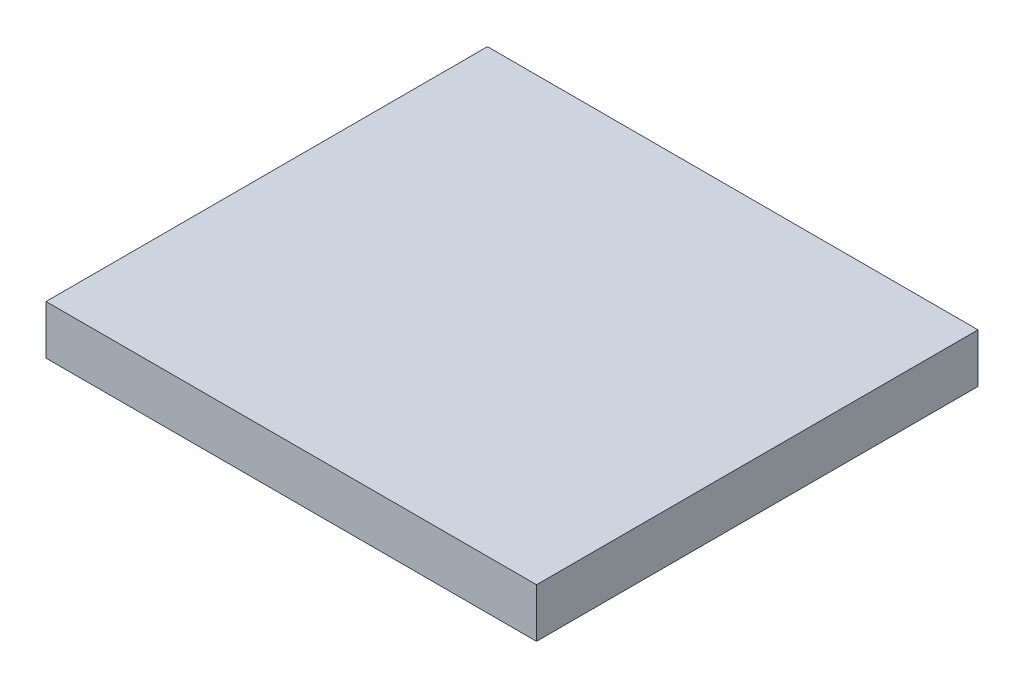
ISO-10303-21;
HEADER;
FILE_DESCRIPTION(('STEP AP214'),'2;1');
FILE_NAME('part.step','',(''),(''),'','','');
FILE_SCHEMA(('AUTOMOTIVE_DESIGN { 1 0 10303 214 1 1 1 1 }'));
ENDSEC;
DATA;
#1=APPLICATION_CONTEXT('core data for automotive mechanical design processes');
#2=APPLICATION_PROTOCOL_DEFINITION('international standard','automotive_design',2000,#1);
#3=PRODUCT_CONTEXT('',#1,'mechanical');
#4=PRODUCT('Part','Part','',(#3));
#5=PRODUCT_RELATED_PRODUCT_CATEGORY('part','',(#4));
#6=PRODUCT_DEFINITION_FORMATION('','',#4);
#7=PRODUCT_DEFINITION_CONTEXT('part definition',#1,'design');
#8=PRODUCT_DEFINITION('design','',#6,#7);
#9=PRODUCT_DEFINITION_SHAPE('','',#8);
#10=(LENGTH_UNIT() NAMED_UNIT(*) SI_UNIT(.MILLI.,.METRE.));
#11=(NAMED_UNIT(*) PLANE_ANGLE_UNIT() SI_UNIT($,.RADIAN.));
#12=(NAMED_UNIT(*) SI_UNIT($,.STERADIAN.) SOLID_ANGLE_UNIT());
#13=UNCERTAINTY_MEASURE_WITH_UNIT(LENGTH_MEASURE(1.E-05),#10,'distance_accuracy_value','');
#14=(GEOMETRIC_REPRESENTATION_CONTEXT(3) GLOBAL_UNCERTAINTY_ASSIGNED_CONTEXT((#13)) GLOBAL_UNIT_ASSIGNED_CONTEXT((#10,
#11,#12)) REPRESENTATION_CONTEXT('',''));
#15=CARTESIAN_POINT('',(0.,0.,0.));
#16=DIRECTION('',(0.,0.,1.));
#17=DIRECTION('',(1.,0.,0.));
#18=AXIS2_PLACEMENT_3D('',#15,#16,#17);
#19=CARTESIAN_POINT('',(50.,10.,-45.));
#20=DIRECTION('',(-1.,0.,0.));
#21=DIRECTION('',(0.,0.,1.));
#22=AXIS2_PLACEMENT_3D('',#19,#20,#21);
#23=PLANE('',#22);
#24=DIRECTION('',(0.,0.,-1.));
#25=VECTOR('',#24,1.);
#26=CARTESIAN_POINT('',(50.,0.,-45.));
#27=LINE('',#26,#25);
#28=CARTESIAN_POINT('',(50.,0.,45.));
#29=VERTEX_POINT('',#28);
#30=CARTESIAN_POINT('',(50.,0.,-45.));
#31=VERTEX_POINT('',#30);
#32=EDGE_CURVE('E99',#29,#31,#27,.T.);
#33=ORIENTED_EDGE('',*,*,#32,.T.);
#34=DIRECTION('',(0.,-1.,0.));
#35=VECTOR('',#34,1.);
#36=CARTESIAN_POINT('',(50.,10.,-45.));
#37=LINE('',#36,#35);
#38=CARTESIAN_POINT('',(50.,10.,-45.));
#39=VERTEX_POINT('',#38);
#40=EDGE_CURVE('E11',#39,#31,#37,.T.);
#41=ORIENTED_EDGE('',*,*,#40,.F.);
#42=DIRECTION('',(0.,0.,-1.));
#43=VECTOR('',#42,1.);
#44=CARTESIAN_POINT('',(50.,10.,-45.));
#45=LINE('',#44,#43);
#46=CARTESIAN_POINT('',(50.,10.,45.));
#47=VERTEX_POINT('',#46);
#48=EDGE_CURVE('E87',#47,#39,#45,.T.);
#49=ORIENTED_EDGE('',*,*,#48,.F.);
#50=DIRECTION('',(0.,-1.,0.));
#51=VECTOR('',#50,1.);
#52=CARTESIAN_POINT('',(50.,10.,45.));
#53=LINE('',#52,#51);
#54=EDGE_CURVE('E95',#47,#29,#53,.T.);
#55=ORIENTED_EDGE('',*,*,#54,.T.);
#56=EDGE_LOOP('',(#33,#41,#49,#55));
#57=FACE_BOUND('',#56,.T.);
#58=ADVANCED_FACE('F36',(#57),#23,.F.);
#59=CARTESIAN_POINT('',(-50.,10.,-45.));
#60=DIRECTION('',(0.,0.,1.));
#61=DIRECTION('',(1.,0.,0.));
#62=AXIS2_PLACEMENT_3D('',#59,#60,#61);
#63=PLANE('',#62);
#64=DIRECTION('',(-1.,0.,0.));
#65=VECTOR('',#64,1.);
#66=CARTESIAN_POINT('',(-50.,0.,-45.));
#67=LINE('',#66,#65);
#68=CARTESIAN_POINT('',(-50.,0.,-45.));
#69=VERTEX_POINT('',#68);
#70=EDGE_CURVE('E91',#31,#69,#67,.T.);
#71=ORIENTED_EDGE('',*,*,#70,.T.);
#72=DIRECTION('',(0.,-1.,0.));
#73=VECTOR('',#72,1.);
#74=CARTESIAN_POINT('',(-50.,10.,-45.));
#75=LINE('',#74,#73);
#76=CARTESIAN_POINT('',(-50.,10.,-45.));
#77=VERTEX_POINT('',#76);
#78=EDGE_CURVE('E44',#77,#69,#75,.T.);
#79=ORIENTED_EDGE('',*,*,#78,.F.);
#80=DIRECTION('',(-1.,0.,0.));
#81=VECTOR('',#80,1.);
#82=CARTESIAN_POINT('',(-50.,10.,-45.));
#83=LINE('',#82,#81);
#84=EDGE_CURVE('E82',#39,#77,#83,.T.);
#85=ORIENTED_EDGE('',*,*,#84,.F.);
#86=ORIENTED_EDGE('',*,*,#40,.T.);
#87=EDGE_LOOP('',(#71,#79,#85,#86));
#88=FACE_BOUND('',#87,.T.);
#89=ADVANCED_FACE('F90',(#88),#63,.F.);
#90=CARTESIAN_POINT('',(-50.,10.,-45.));
#91=DIRECTION('',(1.,0.,0.));
#92=DIRECTION('',(0.,0.,-1.));
#93=AXIS2_PLACEMENT_3D('',#90,#91,#92);
#94=PLANE('',#93);
#95=DIRECTION('',(0.,0.,1.));
#96=VECTOR('',#95,1.);
#97=CARTESIAN_POINT('',(-50.,0.,-45.));
#98=LINE('',#97,#96);
#99=CARTESIAN_POINT('',(-50.,0.,45.));
#100=VERTEX_POINT('',#99);
#101=EDGE_CURVE('E69',#69,#100,#98,.T.);
#102=ORIENTED_EDGE('',*,*,#101,.T.);
#103=DIRECTION('',(0.,-1.,0.));
#104=VECTOR('',#103,1.);
#105=CARTESIAN_POINT('',(-50.,10.,45.));
#106=LINE('',#105,#104);
#107=CARTESIAN_POINT('',(-50.,10.,45.));
#108=VERTEX_POINT('',#107);
#109=EDGE_CURVE('E92',#108,#100,#106,.T.);
#110=ORIENTED_EDGE('',*,*,#109,.F.);
#111=DIRECTION('',(0.,0.,1.));
#112=VECTOR('',#111,1.);
#113=CARTESIAN_POINT('',(-50.,10.,-45.));
#114=LINE('',#113,#112);
#115=EDGE_CURVE('E85',#77,#108,#114,.T.);
#116=ORIENTED_EDGE('',*,*,#115,.F.);
#117=ORIENTED_EDGE('',*,*,#78,.T.);
#118=EDGE_LOOP('',(#102,#110,#116,#117));
#119=FACE_BOUND('',#118,.T.);
#120=ADVANCED_FACE('F93',(#119),#94,.F.);
#121=CARTESIAN_POINT('',(-50.,10.,45.));
#122=DIRECTION('',(0.,0.,-1.));
#123=DIRECTION('',(-1.,0.,0.));
#124=AXIS2_PLACEMENT_3D('',#121,#122,#123);
#125=PLANE('',#124);
#126=DIRECTION('',(1.,0.,0.));
#127=VECTOR('',#126,1.);
#128=CARTESIAN_POINT('',(-50.,0.,45.));
#129=LINE('',#128,#127);
#130=EDGE_CURVE('E75',#100,#29,#129,.T.);
#131=ORIENTED_EDGE('',*,*,#130,.T.);
#132=ORIENTED_EDGE('',*,*,#54,.F.);
#133=DIRECTION('',(1.,0.,0.));
#134=VECTOR('',#133,1.);
#135=CARTESIAN_POINT('',(-50.,10.,45.));
#136=LINE('',#135,#134);
#137=EDGE_CURVE('E52',#108,#47,#136,.T.);
#138=ORIENTED_EDGE('',*,*,#137,.F.);
#139=ORIENTED_EDGE('',*,*,#109,.T.);
#140=EDGE_LOOP('',(#131,#132,#138,#139));
#141=FACE_BOUND('',#140,.T.);
#142=ADVANCED_FACE('F106',(#141),#125,.F.);
#143=CARTESIAN_POINT('',(0.,10.,0.));
#144=DIRECTION('',(0.,1.,0.));
#145=DIRECTION('',(0.,0.,1.));
#146=AXIS2_PLACEMENT_3D('',#143,#144,#145);
#147=PLANE('',#146);
#148=ORIENTED_EDGE('',*,*,#48,.T.);
#149=ORIENTED_EDGE('',*,*,#84,.T.);
#150=ORIENTED_EDGE('',*,*,#115,.T.);
#151=ORIENTED_EDGE('',*,*,#137,.T.);
#152=EDGE_LOOP('',(#148,#149,#150,#151));
#153=FACE_BOUND('',#152,.T.);
#154=ADVANCED_FACE('F83',(#153),#147,.T.);
#155=CARTESIAN_POINT('',(0.,0.,0.));
#156=DIRECTION('',(0.,1.,0.));
#157=DIRECTION('',(0.,0.,1.));
#158=AXIS2_PLACEMENT_3D('',#155,#156,#157);
#159=PLANE('',#158);
#160=ORIENTED_EDGE('',*,*,#32,.F.);
#161=ORIENTED_EDGE('',*,*,#130,.F.);
#162=ORIENTED_EDGE('',*,*,#101,.F.);
#163=ORIENTED_EDGE('',*,*,#70,.F.);
#164=EDGE_LOOP('',(#160,#161,#162,#163));
#165=FACE_BOUND('',#164,.T.);
#166=ADVANCED_FACE('F109',(#165),#159,.F.);
#167=CLOSED_SHELL('',(#58,#89,#120,#142,#154,#166));
#168=MANIFOLD_SOLID_BREP('B2',#167);
#169=ADVANCED_BREP_SHAPE_REPRESENTATION('',(#18,#168),#14);
#170=SHAPE_DEFINITION_REPRESENTATION(#9,#169);
ENDSEC;
END-ISO-10303-21;
